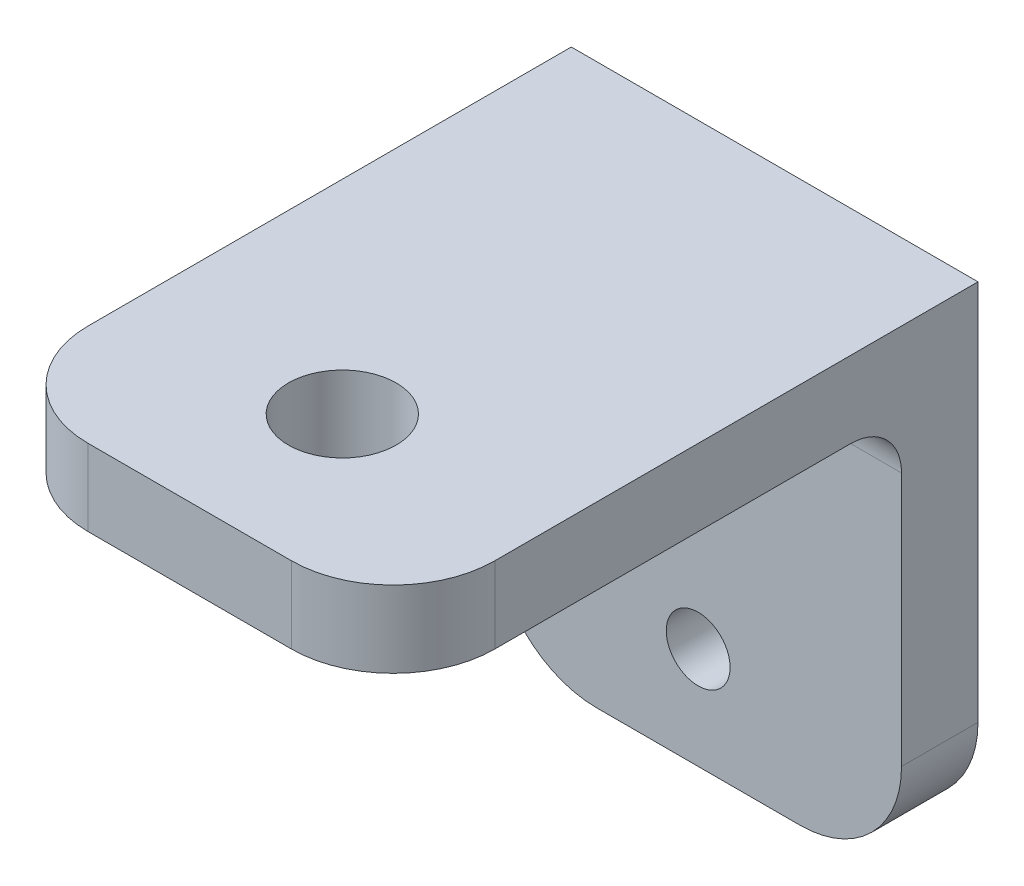
ISO-10303-21;
HEADER;
FILE_DESCRIPTION(('STEP AP214'),'2;1');
FILE_NAME('part.step','',(''),(''),'','','');
FILE_SCHEMA(('AUTOMOTIVE_DESIGN { 1 0 10303 214 1 1 1 1 }'));
ENDSEC;
DATA;
#1=APPLICATION_CONTEXT('core data for automotive mechanical design processes');
#2=APPLICATION_PROTOCOL_DEFINITION('international standard','automotive_design',2000,#1);
#3=PRODUCT_CONTEXT('',#1,'mechanical');
#4=PRODUCT('Part','Part','',(#3));
#5=PRODUCT_RELATED_PRODUCT_CATEGORY('part','',(#4));
#6=PRODUCT_DEFINITION_FORMATION('','',#4);
#7=PRODUCT_DEFINITION_CONTEXT('part definition',#1,'design');
#8=PRODUCT_DEFINITION('design','',#6,#7);
#9=PRODUCT_DEFINITION_SHAPE('','',#8);
#10=(LENGTH_UNIT() NAMED_UNIT(*) SI_UNIT(.MILLI.,.METRE.));
#11=(NAMED_UNIT(*) PLANE_ANGLE_UNIT() SI_UNIT($,.RADIAN.));
#12=(NAMED_UNIT(*) SI_UNIT($,.STERADIAN.) SOLID_ANGLE_UNIT());
#13=UNCERTAINTY_MEASURE_WITH_UNIT(LENGTH_MEASURE(1.E-05),#10,'distance_accuracy_value','');
#14=(GEOMETRIC_REPRESENTATION_CONTEXT(3) GLOBAL_UNCERTAINTY_ASSIGNED_CONTEXT((#13)) GLOBAL_UNIT_ASSIGNED_CONTEXT((#10,
#11,#12)) REPRESENTATION_CONTEXT('',''));
#15=CARTESIAN_POINT('',(0.,0.,0.));
#16=DIRECTION('',(0.,0.,1.));
#17=DIRECTION('',(1.,0.,0.));
#18=AXIS2_PLACEMENT_3D('',#15,#16,#17);
#19=CARTESIAN_POINT('',(0.,25.989203219563,79.0985735246069));
#20=DIRECTION('',(1.,0.,0.));
#21=DIRECTION('',(0.,1.,0.));
#22=AXIS2_PLACEMENT_3D('',#19,#20,#21);
#23=PLANE('',#22);
#24=DIRECTION('',(0.,0.,-1.));
#25=VECTOR('',#24,1.);
#26=CARTESIAN_POINT('',(0.,17.2516032195629,72.3548735246069));
#27=LINE('',#26,#25);
#28=CARTESIAN_POINT('',(0.,17.2516032195629,65.6111735246069));
#29=VERTEX_POINT('',#28);
#30=CARTESIAN_POINT('',(0.,17.2516032195629,60.8359735246069));
#31=VERTEX_POINT('',#30);
#32=EDGE_CURVE('E201',#29,#31,#27,.T.);
#33=ORIENTED_EDGE('',*,*,#32,.F.);
#34=DIRECTION('',(0.,-1.,0.));
#35=VECTOR('',#34,1.);
#36=CARTESIAN_POINT('',(0.,36.301603219563,65.6111735246069));
#37=LINE('',#36,#35);
#38=CARTESIAN_POINT('',(0.,33.126603219563,65.6111735246069));
#39=VERTEX_POINT('',#38);
#40=EDGE_CURVE('E300',#39,#29,#37,.T.);
#41=ORIENTED_EDGE('',*,*,#40,.F.);
#42=CARTESIAN_POINT('',(0.,33.126603219563,68.7861735246069));
#43=DIRECTION('',(-1.,0.,0.));
#44=DIRECTION('',(0.,0.707106781186546,-0.707106781186549));
#45=AXIS2_PLACEMENT_3D('',#42,#43,#44);
#46=CIRCLE('',#45,3.175);
#47=CARTESIAN_POINT('',(0.,36.301603219563,68.7861735246069));
#48=VERTEX_POINT('',#47);
#49=EDGE_CURVE('E231',#48,#39,#46,.T.);
#50=ORIENTED_EDGE('',*,*,#49,.F.);
#51=DIRECTION('',(0.,0.,-1.));
#52=VECTOR('',#51,1.);
#53=CARTESIAN_POINT('',(0.,36.301603219563,97.3611735246069));
#54=LINE('',#53,#52);
#55=CARTESIAN_POINT('',(0.,36.301603219563,91.0111735246069));
#56=VERTEX_POINT('',#55);
#57=EDGE_CURVE('E218',#56,#48,#54,.T.);
#58=ORIENTED_EDGE('',*,*,#57,.F.);
#59=DIRECTION('',(0.,-1.,0.));
#60=VECTOR('',#59,1.);
#61=CARTESIAN_POINT('',(0.,33.533003219563,91.0111735246069));
#62=LINE('',#61,#60);
#63=CARTESIAN_POINT('',(0.,41.076803219563,91.0111735246069));
#64=VERTEX_POINT('',#63);
#65=EDGE_CURVE('E236',#64,#56,#62,.T.);
#66=ORIENTED_EDGE('',*,*,#65,.F.);
#67=DIRECTION('',(0.,0.,1.));
#68=VECTOR('',#67,1.);
#69=CARTESIAN_POINT('',(0.,41.076803219563,60.8359735246069));
#70=LINE('',#69,#68);
#71=CARTESIAN_POINT('',(0.,41.076803219563,60.8359735246069));
#72=VERTEX_POINT('',#71);
#73=EDGE_CURVE('E11',#72,#64,#70,.T.);
#74=ORIENTED_EDGE('',*,*,#73,.F.);
#75=DIRECTION('',(0.,1.,0.));
#76=VECTOR('',#75,1.);
#77=CARTESIAN_POINT('',(0.,10.9016032195629,60.8359735246069));
#78=LINE('',#77,#76);
#79=EDGE_CURVE('E207',#31,#72,#78,.T.);
#80=ORIENTED_EDGE('',*,*,#79,.F.);
#81=EDGE_LOOP('',(#33,#41,#50,#58,#66,#74,#80));
#82=FACE_BOUND('',#81,.T.);
#83=ADVANCED_FACE('F17',(#82),#23,.F.);
#84=CARTESIAN_POINT('',(25.4,25.989203219563,79.0985735246069));
#85=DIRECTION('',(1.,0.,0.));
#86=DIRECTION('',(0.,1.,0.));
#87=AXIS2_PLACEMENT_3D('',#84,#85,#86);
#88=PLANE('',#87);
#89=DIRECTION('',(0.,0.,1.));
#90=VECTOR('',#89,1.);
#91=CARTESIAN_POINT('',(25.4,17.2516032195629,72.3548735246069));
#92=LINE('',#91,#90);
#93=CARTESIAN_POINT('',(25.4,17.2516032195629,60.8359735246069));
#94=VERTEX_POINT('',#93);
#95=CARTESIAN_POINT('',(25.4,17.2516032195629,65.6111735246069));
#96=VERTEX_POINT('',#95);
#97=EDGE_CURVE('E184',#94,#96,#92,.T.);
#98=ORIENTED_EDGE('',*,*,#97,.F.);
#99=DIRECTION('',(0.,1.,0.));
#100=VECTOR('',#99,1.);
#101=CARTESIAN_POINT('',(25.4,10.9016032195629,60.8359735246069));
#102=LINE('',#101,#100);
#103=CARTESIAN_POINT('',(25.4,41.076803219563,60.8359735246069));
#104=VERTEX_POINT('',#103);
#105=EDGE_CURVE('E181',#94,#104,#102,.T.);
#106=ORIENTED_EDGE('',*,*,#105,.T.);
#107=DIRECTION('',(0.,0.,1.));
#108=VECTOR('',#107,1.);
#109=CARTESIAN_POINT('',(25.4,41.076803219563,60.8359735246069));
#110=LINE('',#109,#108);
#111=CARTESIAN_POINT('',(25.4,41.076803219563,91.0111735246069));
#112=VERTEX_POINT('',#111);
#113=EDGE_CURVE('E27',#104,#112,#110,.T.);
#114=ORIENTED_EDGE('',*,*,#113,.T.);
#115=DIRECTION('',(0.,1.,0.));
#116=VECTOR('',#115,1.);
#117=CARTESIAN_POINT('',(25.4,33.533003219563,91.0111735246069));
#118=LINE('',#117,#116);
#119=CARTESIAN_POINT('',(25.4,36.301603219563,91.0111735246069));
#120=VERTEX_POINT('',#119);
#121=EDGE_CURVE('E226',#120,#112,#118,.T.);
#122=ORIENTED_EDGE('',*,*,#121,.F.);
#123=DIRECTION('',(0.,0.,-1.));
#124=VECTOR('',#123,1.);
#125=CARTESIAN_POINT('',(25.4,36.301603219563,97.3611735246069));
#126=LINE('',#125,#124);
#127=CARTESIAN_POINT('',(25.4,36.301603219563,68.7861735246069));
#128=VERTEX_POINT('',#127);
#129=EDGE_CURVE('E266',#120,#128,#126,.T.);
#130=ORIENTED_EDGE('',*,*,#129,.T.);
#131=CARTESIAN_POINT('',(25.4,33.126603219563,68.7861735246069));
#132=DIRECTION('',(1.,0.,0.));
#133=DIRECTION('',(0.,0.707106781186546,-0.707106781186549));
#134=AXIS2_PLACEMENT_3D('',#131,#132,#133);
#135=CIRCLE('',#134,3.175);
#136=CARTESIAN_POINT('',(25.4,33.126603219563,65.6111735246069));
#137=VERTEX_POINT('',#136);
#138=EDGE_CURVE('E294',#137,#128,#135,.T.);
#139=ORIENTED_EDGE('',*,*,#138,.F.);
#140=DIRECTION('',(0.,-1.,0.));
#141=VECTOR('',#140,1.);
#142=CARTESIAN_POINT('',(25.4,36.301603219563,65.6111735246069));
#143=LINE('',#142,#141);
#144=EDGE_CURVE('E297',#137,#96,#143,.T.);
#145=ORIENTED_EDGE('',*,*,#144,.T.);
#146=EDGE_LOOP('',(#98,#106,#114,#122,#130,#139,#145));
#147=FACE_BOUND('',#146,.T.);
#148=ADVANCED_FACE('F328',(#147),#88,.T.);
#149=CARTESIAN_POINT('',(0.,41.076803219563,60.8359735246069));
#150=DIRECTION('',(0.,1.,0.));
#151=DIRECTION('',(0.,0.,-1.));
#152=AXIS2_PLACEMENT_3D('',#149,#150,#151);
#153=PLANE('',#152);
#154=CARTESIAN_POINT('',(12.7,41.076803219563,87.8361735246069));
#155=DIRECTION('',(0.,-1.,0.));
#156=DIRECTION('',(1.,0.,0.));
#157=AXIS2_PLACEMENT_3D('',#154,#155,#156);
#158=CIRCLE('',#157,3.3655);
#159=CARTESIAN_POINT('',(9.3345,41.076803219563,87.8361735246069));
#160=VERTEX_POINT('',#159);
#161=EDGE_CURVE('E38',#160,#160,#158,.T.);
#162=ORIENTED_EDGE('',*,*,#161,.T.);
#163=EDGE_LOOP('',(#162));
#164=FACE_BOUND('',#163,.T.);
#165=CARTESIAN_POINT('',(19.05,41.076803219563,91.0111735246069));
#166=DIRECTION('',(0.,-1.,0.));
#167=DIRECTION('',(0.707106781186547,0.,0.707106781186548));
#168=AXIS2_PLACEMENT_3D('',#165,#166,#167);
#169=CIRCLE('',#168,6.35);
#170=CARTESIAN_POINT('',(19.05,41.076803219563,97.3611735246069));
#171=VERTEX_POINT('',#170);
#172=EDGE_CURVE('E245',#112,#171,#169,.T.);
#173=ORIENTED_EDGE('',*,*,#172,.F.);
#174=ORIENTED_EDGE('',*,*,#113,.F.);
#175=DIRECTION('',(1.,0.,0.));
#176=VECTOR('',#175,1.);
#177=CARTESIAN_POINT('',(0.,41.076803219563,60.8359735246069));
#178=LINE('',#177,#176);
#179=EDGE_CURVE('E213',#72,#104,#178,.T.);
#180=ORIENTED_EDGE('',*,*,#179,.F.);
#181=ORIENTED_EDGE('',*,*,#73,.T.);
#182=CARTESIAN_POINT('',(6.35,41.076803219563,91.0111735246069));
#183=DIRECTION('',(0.,-1.,0.));
#184=DIRECTION('',(-0.707106781186547,0.,0.707106781186548));
#185=AXIS2_PLACEMENT_3D('',#182,#183,#184);
#186=CIRCLE('',#185,6.35);
#187=CARTESIAN_POINT('',(6.35,41.076803219563,97.3611735246069));
#188=VERTEX_POINT('',#187);
#189=EDGE_CURVE('E285',#188,#64,#186,.T.);
#190=ORIENTED_EDGE('',*,*,#189,.F.);
#191=DIRECTION('',(1.,0.,0.));
#192=VECTOR('',#191,1.);
#193=CARTESIAN_POINT('',(0.,41.076803219563,97.3611735246069));
#194=LINE('',#193,#192);
#195=EDGE_CURVE('E274',#188,#171,#194,.T.);
#196=ORIENTED_EDGE('',*,*,#195,.T.);
#197=EDGE_LOOP('',(#173,#174,#180,#181,#190,#196));
#198=FACE_BOUND('',#197,.T.);
#199=ADVANCED_FACE('F19',(#164,#198),#153,.T.);
#200=CARTESIAN_POINT('',(12.7,36.301603219563,87.8361735246069));
#201=DIRECTION('',(0.,1.,0.));
#202=DIRECTION('',(1.,0.,0.));
#203=AXIS2_PLACEMENT_3D('',#200,#201,#202);
#204=CYLINDRICAL_SURFACE('',#203,3.3655);
#205=CARTESIAN_POINT('',(12.7,36.301603219563,87.8361735246069));
#206=DIRECTION('',(0.,1.,0.));
#207=DIRECTION('',(1.,0.,0.));
#208=AXIS2_PLACEMENT_3D('',#205,#206,#207);
#209=CIRCLE('',#208,3.3655);
#210=CARTESIAN_POINT('',(9.3345,36.301603219563,87.8361735246069));
#211=VERTEX_POINT('',#210);
#212=EDGE_CURVE('E270',#211,#211,#209,.T.);
#213=ORIENTED_EDGE('',*,*,#212,.F.);
#214=DIRECTION('',(0.,1.,0.));
#215=VECTOR('',#214,1.);
#216=CARTESIAN_POINT('',(9.3345,36.301603219563,87.8361735246069));
#217=LINE('',#216,#215);
#218=EDGE_CURVE('E21',#211,#160,#217,.T.);
#219=ORIENTED_EDGE('',*,*,#218,.T.);
#220=ORIENTED_EDGE('',*,*,#161,.F.);
#221=ORIENTED_EDGE('',*,*,#218,.F.);
#222=EDGE_LOOP('',(#213,#219,#220,#221));
#223=FACE_BOUND('',#222,.T.);
#224=ADVANCED_FACE('F344',(#223),#204,.F.);
#225=CARTESIAN_POINT('',(12.7,29.951603219563,65.6111735246069));
#226=DIRECTION('',(0.,0.,-1.));
#227=DIRECTION('',(1.,0.,0.));
#228=AXIS2_PLACEMENT_3D('',#225,#226,#227);
#229=CYLINDRICAL_SURFACE('',#228,1.9939);
#230=CARTESIAN_POINT('',(12.7,29.951603219563,65.6111735246069));
#231=DIRECTION('',(0.,0.,-1.));
#232=DIRECTION('',(1.,0.,0.));
#233=AXIS2_PLACEMENT_3D('',#230,#231,#232);
#234=CIRCLE('',#233,1.9939);
#235=CARTESIAN_POINT('',(10.7061,29.951603219563,65.6111735246069));
#236=VERTEX_POINT('',#235);
#237=EDGE_CURVE('E303',#236,#236,#234,.T.);
#238=ORIENTED_EDGE('',*,*,#237,.F.);
#239=DIRECTION('',(0.,0.,-1.));
#240=VECTOR('',#239,1.);
#241=CARTESIAN_POINT('',(10.7061,29.951603219563,65.6111735246069));
#242=LINE('',#241,#240);
#243=CARTESIAN_POINT('',(10.7061,29.951603219563,60.8359735246069));
#244=VERTEX_POINT('',#243);
#245=EDGE_CURVE('E261',#236,#244,#242,.T.);
#246=ORIENTED_EDGE('',*,*,#245,.T.);
#247=CARTESIAN_POINT('',(12.7,29.951603219563,60.8359735246069));
#248=DIRECTION('',(0.,0.,1.));
#249=DIRECTION('',(1.,0.,0.));
#250=AXIS2_PLACEMENT_3D('',#247,#248,#249);
#251=CIRCLE('',#250,1.9939);
#252=EDGE_CURVE('E190',#244,#244,#251,.T.);
#253=ORIENTED_EDGE('',*,*,#252,.F.);
#254=ORIENTED_EDGE('',*,*,#245,.F.);
#255=EDGE_LOOP('',(#238,#246,#253,#254));
#256=FACE_BOUND('',#255,.T.);
#257=ADVANCED_FACE('F339',(#256),#229,.F.);
#258=CARTESIAN_POINT('',(12.7,17.2516032195629,65.6111735246069));
#259=DIRECTION('',(0.,0.,-1.));
#260=DIRECTION('',(1.,0.,0.));
#261=AXIS2_PLACEMENT_3D('',#258,#259,#260);
#262=CYLINDRICAL_SURFACE('',#261,1.9939);
#263=CARTESIAN_POINT('',(12.7,17.2516032195629,65.6111735246069));
#264=DIRECTION('',(0.,0.,-1.));
#265=DIRECTION('',(1.,0.,0.));
#266=AXIS2_PLACEMENT_3D('',#263,#264,#265);
#267=CIRCLE('',#266,1.9939);
#268=CARTESIAN_POINT('',(10.7061,17.2516032195629,65.6111735246069));
#269=VERTEX_POINT('',#268);
#270=EDGE_CURVE('E262',#269,#269,#267,.T.);
#271=ORIENTED_EDGE('',*,*,#270,.F.);
#272=DIRECTION('',(0.,0.,-1.));
#273=VECTOR('',#272,1.);
#274=CARTESIAN_POINT('',(10.7061,17.2516032195629,65.6111735246069));
#275=LINE('',#274,#273);
#276=CARTESIAN_POINT('',(10.7061,17.2516032195629,60.8359735246069));
#277=VERTEX_POINT('',#276);
#278=EDGE_CURVE('E47',#269,#277,#275,.T.);
#279=ORIENTED_EDGE('',*,*,#278,.T.);
#280=CARTESIAN_POINT('',(12.7,17.2516032195629,60.8359735246069));
#281=DIRECTION('',(0.,0.,1.));
#282=DIRECTION('',(1.,0.,0.));
#283=AXIS2_PLACEMENT_3D('',#280,#281,#282);
#284=CIRCLE('',#283,1.9939);
#285=EDGE_CURVE('E195',#277,#277,#284,.T.);
#286=ORIENTED_EDGE('',*,*,#285,.F.);
#287=ORIENTED_EDGE('',*,*,#278,.F.);
#288=EDGE_LOOP('',(#271,#279,#286,#287));
#289=FACE_BOUND('',#288,.T.);
#290=ADVANCED_FACE('F312',(#289),#262,.F.);
#291=CARTESIAN_POINT('',(0.,36.301603219563,65.6111735246069));
#292=DIRECTION('',(0.,0.,1.));
#293=DIRECTION('',(1.,0.,0.));
#294=AXIS2_PLACEMENT_3D('',#291,#292,#293);
#295=PLANE('',#294);
#296=ORIENTED_EDGE('',*,*,#270,.T.);
#297=EDGE_LOOP('',(#296));
#298=FACE_BOUND('',#297,.T.);
#299=ORIENTED_EDGE('',*,*,#237,.T.);
#300=EDGE_LOOP('',(#299));
#301=FACE_BOUND('',#300,.T.);
#302=CARTESIAN_POINT('',(19.05,17.2516032195629,65.6111735246069));
#303=DIRECTION('',(0.,0.,-1.));
#304=DIRECTION('',(0.707106781186548,-0.707106781186548,0.));
#305=AXIS2_PLACEMENT_3D('',#302,#303,#304);
#306=CIRCLE('',#305,6.35);
#307=CARTESIAN_POINT('',(19.05,10.9016032195629,65.6111735246069));
#308=VERTEX_POINT('',#307);
#309=EDGE_CURVE('E175',#96,#308,#306,.T.);
#310=ORIENTED_EDGE('',*,*,#309,.F.);
#311=ORIENTED_EDGE('',*,*,#144,.F.);
#312=DIRECTION('',(1.,0.,0.));
#313=VECTOR('',#312,1.);
#314=CARTESIAN_POINT('',(0.,33.126603219563,65.6111735246069));
#315=LINE('',#314,#313);
#316=EDGE_CURVE('E235',#39,#137,#315,.T.);
#317=ORIENTED_EDGE('',*,*,#316,.F.);
#318=ORIENTED_EDGE('',*,*,#40,.T.);
#319=CARTESIAN_POINT('',(6.35,17.2516032195629,65.6111735246069));
#320=DIRECTION('',(0.,0.,-1.));
#321=DIRECTION('',(-0.707106781186547,-0.707106781186548,0.));
#322=AXIS2_PLACEMENT_3D('',#319,#320,#321);
#323=CIRCLE('',#322,6.35);
#324=CARTESIAN_POINT('',(6.35,10.9016032195629,65.6111735246069));
#325=VERTEX_POINT('',#324);
#326=EDGE_CURVE('E198',#325,#29,#323,.T.);
#327=ORIENTED_EDGE('',*,*,#326,.F.);
#328=DIRECTION('',(1.,0.,0.));
#329=VECTOR('',#328,1.);
#330=CARTESIAN_POINT('',(0.,10.9016032195629,65.6111735246069));
#331=LINE('',#330,#329);
#332=EDGE_CURVE('E194',#325,#308,#331,.T.);
#333=ORIENTED_EDGE('',*,*,#332,.T.);
#334=EDGE_LOOP('',(#310,#311,#317,#318,#327,#333));
#335=FACE_BOUND('',#334,.T.);
#336=ADVANCED_FACE('F310',(#298,#301,#335),#295,.T.);
#337=CARTESIAN_POINT('',(0.,33.126603219563,68.7861735246069));
#338=DIRECTION('',(1.,0.,0.));
#339=DIRECTION('',(0.,0.707106781186546,-0.707106781186549));
#340=AXIS2_PLACEMENT_3D('',#337,#338,#339);
#341=CYLINDRICAL_SURFACE('',#340,3.175);
#342=ORIENTED_EDGE('',*,*,#49,.T.);
#343=ORIENTED_EDGE('',*,*,#316,.T.);
#344=ORIENTED_EDGE('',*,*,#138,.T.);
#345=DIRECTION('',(-1.,0.,0.));
#346=VECTOR('',#345,1.);
#347=CARTESIAN_POINT('',(0.,36.301603219563,68.7861735246069));
#348=LINE('',#347,#346);
#349=EDGE_CURVE('E258',#128,#48,#348,.T.);
#350=ORIENTED_EDGE('',*,*,#349,.T.);
#351=EDGE_LOOP('',(#342,#343,#344,#350));
#352=FACE_BOUND('',#351,.T.);
#353=ADVANCED_FACE('F362',(#352),#341,.F.);
#354=CARTESIAN_POINT('',(6.35,33.533003219563,91.0111735246069));
#355=DIRECTION('',(0.,-1.,0.));
#356=DIRECTION('',(-0.707106781186547,0.,0.707106781186548));
#357=AXIS2_PLACEMENT_3D('',#354,#355,#356);
#358=CYLINDRICAL_SURFACE('',#357,6.35);
#359=CARTESIAN_POINT('',(6.35,36.301603219563,91.0111735246069));
#360=DIRECTION('',(0.,1.,0.));
#361=DIRECTION('',(-0.707106781186547,0.,0.707106781186548));
#362=AXIS2_PLACEMENT_3D('',#359,#360,#361);
#363=CIRCLE('',#362,6.35);
#364=CARTESIAN_POINT('',(6.35,36.301603219563,97.3611735246069));
#365=VERTEX_POINT('',#364);
#366=EDGE_CURVE('E214',#56,#365,#363,.T.);
#367=ORIENTED_EDGE('',*,*,#366,.T.);
#368=DIRECTION('',(0.,1.,0.));
#369=VECTOR('',#368,1.);
#370=CARTESIAN_POINT('',(6.35,33.533003219563,97.3611735246069));
#371=LINE('',#370,#369);
#372=EDGE_CURVE('E281',#365,#188,#371,.T.);
#373=ORIENTED_EDGE('',*,*,#372,.T.);
#374=ORIENTED_EDGE('',*,*,#189,.T.);
#375=ORIENTED_EDGE('',*,*,#65,.T.);
#376=EDGE_LOOP('',(#367,#373,#374,#375));
#377=FACE_BOUND('',#376,.T.);
#378=ADVANCED_FACE('F358',(#377),#358,.T.);
#379=CARTESIAN_POINT('',(0.,41.076803219563,97.3611735246069));
#380=DIRECTION('',(0.,0.,1.));
#381=DIRECTION('',(1.,0.,0.));
#382=AXIS2_PLACEMENT_3D('',#379,#380,#381);
#383=PLANE('',#382);
#384=DIRECTION('',(0.,-1.,0.));
#385=VECTOR('',#384,1.);
#386=CARTESIAN_POINT('',(19.05,33.533003219563,97.3611735246069));
#387=LINE('',#386,#385);
#388=CARTESIAN_POINT('',(19.05,36.301603219563,97.3611735246069));
#389=VERTEX_POINT('',#388);
#390=EDGE_CURVE('E249',#171,#389,#387,.T.);
#391=ORIENTED_EDGE('',*,*,#390,.F.);
#392=ORIENTED_EDGE('',*,*,#195,.F.);
#393=ORIENTED_EDGE('',*,*,#372,.F.);
#394=DIRECTION('',(1.,0.,0.));
#395=VECTOR('',#394,1.);
#396=CARTESIAN_POINT('',(0.,36.301603219563,97.3611735246069));
#397=LINE('',#396,#395);
#398=EDGE_CURVE('E219',#365,#389,#397,.T.);
#399=ORIENTED_EDGE('',*,*,#398,.T.);
#400=EDGE_LOOP('',(#391,#392,#393,#399));
#401=FACE_BOUND('',#400,.T.);
#402=ADVANCED_FACE('F354',(#401),#383,.T.);
#403=CARTESIAN_POINT('',(0.,36.301603219563,97.3611735246069));
#404=DIRECTION('',(0.,-1.,0.));
#405=DIRECTION('',(0.,0.,-1.));
#406=AXIS2_PLACEMENT_3D('',#403,#404,#405);
#407=PLANE('',#406);
#408=ORIENTED_EDGE('',*,*,#212,.T.);
#409=EDGE_LOOP('',(#408));
#410=FACE_BOUND('',#409,.T.);
#411=CARTESIAN_POINT('',(19.05,36.301603219563,91.0111735246069));
#412=DIRECTION('',(0.,1.,0.));
#413=DIRECTION('',(0.707106781186547,0.,0.707106781186548));
#414=AXIS2_PLACEMENT_3D('',#411,#412,#413);
#415=CIRCLE('',#414,6.35);
#416=EDGE_CURVE('E222',#389,#120,#415,.T.);
#417=ORIENTED_EDGE('',*,*,#416,.F.);
#418=ORIENTED_EDGE('',*,*,#398,.F.);
#419=ORIENTED_EDGE('',*,*,#366,.F.);
#420=ORIENTED_EDGE('',*,*,#57,.T.);
#421=ORIENTED_EDGE('',*,*,#349,.F.);
#422=ORIENTED_EDGE('',*,*,#129,.F.);
#423=EDGE_LOOP('',(#417,#418,#419,#420,#421,#422));
#424=FACE_BOUND('',#423,.T.);
#425=ADVANCED_FACE('F350',(#410,#424),#407,.T.);
#426=CARTESIAN_POINT('',(19.05,33.533003219563,91.0111735246069));
#427=DIRECTION('',(0.,-1.,0.));
#428=DIRECTION('',(0.707106781186547,0.,0.707106781186548));
#429=AXIS2_PLACEMENT_3D('',#426,#427,#428);
#430=CYLINDRICAL_SURFACE('',#429,6.35);
#431=ORIENTED_EDGE('',*,*,#416,.T.);
#432=ORIENTED_EDGE('',*,*,#121,.T.);
#433=ORIENTED_EDGE('',*,*,#172,.T.);
#434=ORIENTED_EDGE('',*,*,#390,.T.);
#435=EDGE_LOOP('',(#431,#432,#433,#434));
#436=FACE_BOUND('',#435,.T.);
#437=ADVANCED_FACE('F342',(#436),#430,.T.);
#438=CARTESIAN_POINT('',(6.35,17.2516032195629,72.3548735246069));
#439=DIRECTION('',(0.,0.,-1.));
#440=DIRECTION('',(-0.707106781186547,-0.707106781186548,0.));
#441=AXIS2_PLACEMENT_3D('',#438,#439,#440);
#442=CYLINDRICAL_SURFACE('',#441,6.35);
#443=CARTESIAN_POINT('',(6.35,17.2516032195629,60.8359735246069));
#444=DIRECTION('',(0.,0.,1.));
#445=DIRECTION('',(-0.707106781186547,-0.707106781186548,0.));
#446=AXIS2_PLACEMENT_3D('',#443,#444,#445);
#447=CIRCLE('',#446,6.35);
#448=CARTESIAN_POINT('',(6.35,10.9016032195629,60.8359735246069));
#449=VERTEX_POINT('',#448);
#450=EDGE_CURVE('E167',#31,#449,#447,.T.);
#451=ORIENTED_EDGE('',*,*,#450,.T.);
#452=DIRECTION('',(0.,0.,1.));
#453=VECTOR('',#452,1.);
#454=CARTESIAN_POINT('',(6.35,10.9016032195629,72.3548735246069));
#455=LINE('',#454,#453);
#456=EDGE_CURVE('E161',#449,#325,#455,.T.);
#457=ORIENTED_EDGE('',*,*,#456,.T.);
#458=ORIENTED_EDGE('',*,*,#326,.T.);
#459=ORIENTED_EDGE('',*,*,#32,.T.);
#460=EDGE_LOOP('',(#451,#457,#458,#459));
#461=FACE_BOUND('',#460,.T.);
#462=ADVANCED_FACE('F324',(#461),#442,.T.);
#463=CARTESIAN_POINT('',(0.,10.9016032195629,65.6111735246069));
#464=DIRECTION('',(0.,-1.,0.));
#465=DIRECTION('',(0.,0.,-1.));
#466=AXIS2_PLACEMENT_3D('',#463,#464,#465);
#467=PLANE('',#466);
#468=DIRECTION('',(0.,0.,-1.));
#469=VECTOR('',#468,1.);
#470=CARTESIAN_POINT('',(19.05,10.9016032195629,72.3548735246069));
#471=LINE('',#470,#469);
#472=CARTESIAN_POINT('',(19.05,10.9016032195629,60.8359735246069));
#473=VERTEX_POINT('',#472);
#474=EDGE_CURVE('E158',#308,#473,#471,.T.);
#475=ORIENTED_EDGE('',*,*,#474,.F.);
#476=ORIENTED_EDGE('',*,*,#332,.F.);
#477=ORIENTED_EDGE('',*,*,#456,.F.);
#478=DIRECTION('',(1.,0.,0.));
#479=VECTOR('',#478,1.);
#480=CARTESIAN_POINT('',(0.,10.9016032195629,60.8359735246069));
#481=LINE('',#480,#479);
#482=EDGE_CURVE('E154',#449,#473,#481,.T.);
#483=ORIENTED_EDGE('',*,*,#482,.T.);
#484=EDGE_LOOP('',(#475,#476,#477,#483));
#485=FACE_BOUND('',#484,.T.);
#486=ADVANCED_FACE('F156',(#485),#467,.T.);
#487=CARTESIAN_POINT('',(0.,10.9016032195629,60.8359735246069));
#488=DIRECTION('',(0.,0.,-1.));
#489=DIRECTION('',(-1.,0.,0.));
#490=AXIS2_PLACEMENT_3D('',#487,#488,#489);
#491=PLANE('',#490);
#492=ORIENTED_EDGE('',*,*,#252,.T.);
#493=EDGE_LOOP('',(#492));
#494=FACE_BOUND('',#493,.T.);
#495=ORIENTED_EDGE('',*,*,#285,.T.);
#496=EDGE_LOOP('',(#495));
#497=FACE_BOUND('',#496,.T.);
#498=CARTESIAN_POINT('',(19.05,17.2516032195629,60.8359735246069));
#499=DIRECTION('',(0.,0.,1.));
#500=DIRECTION('',(0.707106781186548,-0.707106781186548,0.));
#501=AXIS2_PLACEMENT_3D('',#498,#499,#500);
#502=CIRCLE('',#501,6.35);
#503=EDGE_CURVE('E173',#473,#94,#502,.T.);
#504=ORIENTED_EDGE('',*,*,#503,.F.);
#505=ORIENTED_EDGE('',*,*,#482,.F.);
#506=ORIENTED_EDGE('',*,*,#450,.F.);
#507=ORIENTED_EDGE('',*,*,#79,.T.);
#508=ORIENTED_EDGE('',*,*,#179,.T.);
#509=ORIENTED_EDGE('',*,*,#105,.F.);
#510=EDGE_LOOP('',(#504,#505,#506,#507,#508,#509));
#511=FACE_BOUND('',#510,.T.);
#512=ADVANCED_FACE('F178',(#494,#497,#511),#491,.T.);
#513=CARTESIAN_POINT('',(19.05,17.2516032195629,72.3548735246069));
#514=DIRECTION('',(0.,0.,-1.));
#515=DIRECTION('',(0.707106781186548,-0.707106781186548,0.));
#516=AXIS2_PLACEMENT_3D('',#513,#514,#515);
#517=CYLINDRICAL_SURFACE('',#516,6.35);
#518=ORIENTED_EDGE('',*,*,#503,.T.);
#519=ORIENTED_EDGE('',*,*,#97,.T.);
#520=ORIENTED_EDGE('',*,*,#309,.T.);
#521=ORIENTED_EDGE('',*,*,#474,.T.);
#522=EDGE_LOOP('',(#518,#519,#520,#521));
#523=FACE_BOUND('',#522,.T.);
#524=ADVANCED_FACE('F171',(#523),#517,.T.);
#525=CLOSED_SHELL('',(#83,#148,#199,#224,#257,#290,#336,#353,#378,#402,#425,#437,#462,#486,#512,#524));
#526=MANIFOLD_SOLID_BREP('B1',#525);
#527=ADVANCED_BREP_SHAPE_REPRESENTATION('',(#18,#526),#14);
#528=SHAPE_DEFINITION_REPRESENTATION(#9,#527);
ENDSEC;
END-ISO-10303-21;
